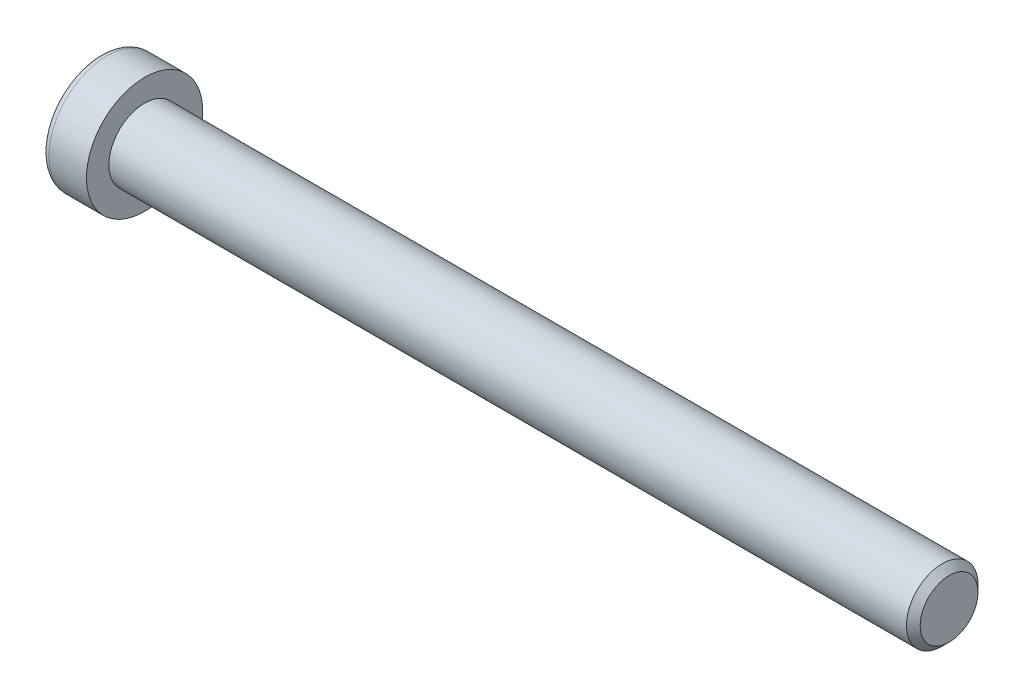
ISO-10303-21;
HEADER;
FILE_DESCRIPTION(('STEP AP214'),'2;1');
FILE_NAME('part.step','',(''),(''),'','','');
FILE_SCHEMA(('AUTOMOTIVE_DESIGN { 1 0 10303 214 1 1 1 1 }'));
ENDSEC;
DATA;
#1=APPLICATION_CONTEXT('core data for automotive mechanical design processes');
#2=APPLICATION_PROTOCOL_DEFINITION('international standard','automotive_design',2000,#1);
#3=PRODUCT_CONTEXT('',#1,'mechanical');
#4=PRODUCT('Part','Part','',(#3));
#5=PRODUCT_RELATED_PRODUCT_CATEGORY('part','',(#4));
#6=PRODUCT_DEFINITION_FORMATION('','',#4);
#7=PRODUCT_DEFINITION_CONTEXT('part definition',#1,'design');
#8=PRODUCT_DEFINITION('design','',#6,#7);
#9=PRODUCT_DEFINITION_SHAPE('','',#8);
#10=(LENGTH_UNIT() NAMED_UNIT(*) SI_UNIT(.MILLI.,.METRE.));
#11=(NAMED_UNIT(*) PLANE_ANGLE_UNIT() SI_UNIT($,.RADIAN.));
#12=(NAMED_UNIT(*) SI_UNIT($,.STERADIAN.) SOLID_ANGLE_UNIT());
#13=UNCERTAINTY_MEASURE_WITH_UNIT(LENGTH_MEASURE(1.E-05),#10,'distance_accuracy_value','');
#14=(GEOMETRIC_REPRESENTATION_CONTEXT(3) GLOBAL_UNCERTAINTY_ASSIGNED_CONTEXT((#13)) GLOBAL_UNIT_ASSIGNED_CONTEXT((#10,
#11,#12)) REPRESENTATION_CONTEXT('',''));
#15=CARTESIAN_POINT('',(0.,0.,0.));
#16=DIRECTION('',(0.,0.,1.));
#17=DIRECTION('',(1.,0.,0.));
#18=AXIS2_PLACEMENT_3D('',#15,#16,#17);
#19=CARTESIAN_POINT('',(-1.21000000177673,0.,0.));
#20=DIRECTION('',(-1.,0.,0.));
#21=DIRECTION('',(0.,0.,1.));
#22=AXIS2_PLACEMENT_3D('',#19,#20,#21);
#23=CONICAL_SURFACE('',#22,2.90407185309505,1.04719754999957);
#24=CARTESIAN_POINT('',(0.466666668955895,5.6843418860808E-11,0.));
#25=VERTEX_POINT('',#24);
#26=VERTEX_LOOP('',#25);
#27=FACE_BOUND('',#26,.T.);
#28=CARTESIAN_POINT('',(-1.20000000185429,2.50000000042234,1.44337567243878));
#29=CARTESIAN_POINT('',(-1.16336943333853,2.50000000015169,1.31652043354164));
#30=CARTESIAN_POINT('',(-1.13005584829276,2.50000000004066,1.18857018204665));
#31=CARTESIAN_POINT('',(-1.07190798608053,2.49999999995925,0.93045430604843));
#32=CARTESIAN_POINT('',(-1.0470942771784,2.49999999998921,0.800284096818482));
#33=CARTESIAN_POINT('',(-1.00846995034978,2.50000000001052,0.541556812507297));
#34=CARTESIAN_POINT('',(-0.994402236146722,2.50000000000281,0.413039534784192));
#35=CARTESIAN_POINT('',(-0.977611461809563,2.4999999999972,0.155400578578008));
#36=CARTESIAN_POINT('',(-0.97487449412654,2.4999999999993,0.026279835899947));
#37=CARTESIAN_POINT('',(-0.980582864405528,2.50000000000061,-0.214968419940874));
#38=CARTESIAN_POINT('',(-0.987626608260427,2.50000000000017,-0.327132134370465));
#39=CARTESIAN_POINT('',(-1.00994662769971,2.49999999999984,-0.550728853213828));
#40=CARTESIAN_POINT('',(-1.02523052029679,2.49999999999995,-0.662161084843472));
#41=CARTESIAN_POINT('',(-1.06343729358341,2.50000000000005,-0.886218434013149));
#42=CARTESIAN_POINT('',(-1.0865220547246,2.50000000000003,-0.998815208377068));
#43=CARTESIAN_POINT('',(-1.13891470308709,2.49999999999998,-1.22232986192457));
#44=CARTESIAN_POINT('',(-1.16821028802302,2.49999999999995,-1.33325060238035));
#45=CARTESIAN_POINT('',(-1.20000000212892,2.5,-1.44337567243228));
#46=B_SPLINE_CURVE_WITH_KNOTS('',3,(#28,#29,#30,#31,#32,#33,#34,#35,#36,#37,#38,#39,#40,#41,#42,
#43,#44,#45),.UNSPECIFIED.,.F.,.F.,(4,2,2,2,2,2,2,2,4),(0.,0.396270014512682,0.793492271431064,
1.18088450787844,1.56780111134321,1.90463472820817,2.2417802418617,2.586402027447,
2.93034746594209),.UNSPECIFIED.);
#47=CARTESIAN_POINT('',(-1.20000000210952,2.49999999973631,1.44337567282182));
#48=VERTEX_POINT('',#47);
#49=CARTESIAN_POINT('',(-1.20000000219742,2.5,-1.44337567266958));
#50=VERTEX_POINT('',#49);
#51=EDGE_CURVE('E19',#48,#50,#46,.T.);
#52=ORIENTED_EDGE('',*,*,#51,.T.);
#53=CARTESIAN_POINT('',(-1.20000000185429,2.4999999997476,-1.44337567360747));
#54=CARTESIAN_POINT('',(-1.16336943333853,2.3901401401242,-1.50680329282164));
#55=CARTESIAN_POINT('',(-1.13005584829276,2.27933197185342,-1.57077841847298));
#56=CARTESIAN_POINT('',(-1.07190798608053,2.05579706607819,-1.69983635640159));
#57=CARTESIAN_POINT('',(-1.0470942771784,1.9430663580841,-1.76492146104251));
#58=CARTESIAN_POINT('',(-1.00846995034978,1.71900195722911,-1.89428510321656));
#59=CARTESIAN_POINT('',(-0.994402236146722,1.60770272989182,-1.95854374207143));
#60=CARTESIAN_POINT('',(-0.977611461809562,1.38458084880996,-2.08736322016967));
#61=CARTESIAN_POINT('',(-0.974874494126539,1.27275900549629,-2.15192359151051));
#62=CARTESIAN_POINT('',(-0.980582864405527,1.06383188732011,-2.27254771943206));
#63=CARTESIAN_POINT('',(-0.987626608260426,0.966695261241037,-2.32862957664647));
#64=CARTESIAN_POINT('',(-1.00994662769971,0.773054822519673,-2.44042793606787));
#65=CARTESIAN_POINT('',(-1.02523052029679,0.676551679128068,-2.49614405188279));
#66=CARTESIAN_POINT('',(-1.06343729358341,0.482512322842576,-2.60817272646771));
#67=CARTESIAN_POINT('',(-1.0865220547246,0.385000655859225,-2.66447111364965));
#68=CARTESIAN_POINT('',(-1.13891470308709,0.191431287768985,-2.77622844042336));
#69=CARTESIAN_POINT('',(-1.16821028802302,0.0953711087276893,-2.83168881065123));
#70=CARTESIAN_POINT('',(-1.20000000212891,4.69203677421693E-10,-2.88675134567723));
#71=B_SPLINE_CURVE_WITH_KNOTS('',3,(#53,#54,#55,#56,#57,#58,#59,#60,#61,#62,#63,#64,#65,#66,#67,
#68,#69,#70),.UNSPECIFIED.,.F.,.F.,(4,2,2,2,2,2,2,2,4),(0.,0.396270014512682,0.793492271431064,
1.18088450787844,1.56780111134321,1.90463472820816,2.2417802418617,2.586402027447,
2.93034746594209),.UNSPECIFIED.);
#72=CARTESIAN_POINT('',(-1.20000000210952,0.,-2.88675134564365));
#73=VERTEX_POINT('',#72);
#74=EDGE_CURVE('E79',#50,#73,#71,.T.);
#75=ORIENTED_EDGE('',*,*,#74,.T.);
#76=CARTESIAN_POINT('',(-1.20000000185429,-6.74740305693329E-10,-2.88675134604625));
#77=CARTESIAN_POINT('',(-1.16336943333853,-0.109859860027481,-2.82332372636328));
#78=CARTESIAN_POINT('',(-1.13005584829276,-0.220668028187231,-2.75934860051963));
#79=CARTESIAN_POINT('',(-1.07190798608053,-0.44420293388106,-2.63029066245002));
#80=CARTESIAN_POINT('',(-1.0470942771784,-0.556933641905113,-2.565205557861));
#81=CARTESIAN_POINT('',(-1.00846995034978,-0.780998042781413,-2.43584191572386));
#82=CARTESIAN_POINT('',(-0.994402236146722,-0.892297270110983,-2.37158327685562));
#83=CARTESIAN_POINT('',(-0.977611461809562,-1.11541915118724,-2.24276379874768));
#84=CARTESIAN_POINT('',(-0.974874494126539,-1.22724099450301,-2.17820342741046));
#85=CARTESIAN_POINT('',(-0.980582864405527,-1.4361681126805,-2.05757929949119));
#86=CARTESIAN_POINT('',(-0.987626608260426,-1.53330473875913,-2.00149744227601));
#87=CARTESIAN_POINT('',(-1.00994662769971,-1.72694517748016,-1.88969908285404));
#88=CARTESIAN_POINT('',(-1.02523052029679,-1.82344832087188,-1.83398296703932));
#89=CARTESIAN_POINT('',(-1.06343729358341,-2.01748767715747,-1.72195429245457));
#90=CARTESIAN_POINT('',(-1.0865220547246,-2.1149993441408,-1.66565590527259));
#91=CARTESIAN_POINT('',(-1.13891470308709,-2.30856871223099,-1.55389857849879));
#92=CARTESIAN_POINT('',(-1.16821028802302,-2.40462889127226,-1.49843820827088));
#93=CARTESIAN_POINT('',(-1.20000000212892,-2.4999999995308,-1.44337567324496));
#94=B_SPLINE_CURVE_WITH_KNOTS('',3,(#76,#77,#78,#79,#80,#81,#82,#83,#84,#85,#86,#87,#88,#89,#90,
#91,#92,#93),.UNSPECIFIED.,.F.,.F.,(4,2,2,2,2,2,2,2,4),(0.,0.396270014512681,0.793492271431064,
1.18088450787844,1.56780111134321,1.90463472820817,2.2417802418617,2.58640202744701,
2.93034746594209),.UNSPECIFIED.);
#95=CARTESIAN_POINT('',(-1.20000000210952,-2.49999999973631,-1.44337567282182));
#96=VERTEX_POINT('',#95);
#97=EDGE_CURVE('E104',#73,#96,#94,.T.);
#98=ORIENTED_EDGE('',*,*,#97,.T.);
#99=CARTESIAN_POINT('',(-1.20000000185429,-2.50000000042234,-1.44337567243878));
#100=CARTESIAN_POINT('',(-1.16336943333853,-2.50000000015169,-1.31652043354164));
#101=CARTESIAN_POINT('',(-1.13005584829276,-2.50000000004065,-1.18857018204665));
#102=CARTESIAN_POINT('',(-1.07190798608053,-2.49999999995925,-0.930454306048433));
#103=CARTESIAN_POINT('',(-1.0470942771784,-2.49999999998921,-0.800284096818485));
#104=CARTESIAN_POINT('',(-1.00846995034978,-2.50000000001052,-0.5415568125073));
#105=CARTESIAN_POINT('',(-0.994402236146721,-2.5000000000028,-0.413039534784196));
#106=CARTESIAN_POINT('',(-0.977611461809562,-2.4999999999972,-0.155400578578012));
#107=CARTESIAN_POINT('',(-0.974874494126539,-2.4999999999993,-0.0262798358999509));
#108=CARTESIAN_POINT('',(-0.980582864405527,-2.50000000000061,0.214968419940871));
#109=CARTESIAN_POINT('',(-0.987626608260426,-2.50000000000016,0.327132134370461));
#110=CARTESIAN_POINT('',(-1.00994662769971,-2.49999999999984,0.550728853213825));
#111=CARTESIAN_POINT('',(-1.02523052029678,-2.49999999999995,0.662161084843469));
#112=CARTESIAN_POINT('',(-1.06343729358341,-2.50000000000005,0.886218434013146));
#113=CARTESIAN_POINT('',(-1.0865220547246,-2.50000000000002,0.998815208377065));
#114=CARTESIAN_POINT('',(-1.13891470308709,-2.49999999999998,1.22232986192457));
#115=CARTESIAN_POINT('',(-1.16821028802301,-2.49999999999995,1.33325060238035));
#116=CARTESIAN_POINT('',(-1.20000000212891,-2.5,1.44337567243227));
#117=B_SPLINE_CURVE_WITH_KNOTS('',3,(#99,#100,#101,#102,#103,#104,#105,#106,#107,#108,#109,#110,
#111,#112,#113,#114,#115,#116),.UNSPECIFIED.,.F.,.F.,(4,2,2,2,2,2,2,2,4),(0.,0.396270014512682,
0.793492271431064,1.18088450787844,1.56780111134321,1.90463472820816,2.2417802418617,
2.586402027447,2.93034746594209),.UNSPECIFIED.);
#118=CARTESIAN_POINT('',(-1.20000000210952,-2.49999999973631,1.44337567282182));
#119=VERTEX_POINT('',#118);
#120=EDGE_CURVE('E128',#96,#119,#117,.T.);
#121=ORIENTED_EDGE('',*,*,#120,.T.);
#122=CARTESIAN_POINT('',(-1.20000000185429,-2.4999999997476,1.44337567360746));
#123=CARTESIAN_POINT('',(-1.16336943333853,-2.39014014012421,1.50680329282164));
#124=CARTESIAN_POINT('',(-1.13005584829276,-2.27933197185342,1.57077841847298));
#125=CARTESIAN_POINT('',(-1.07190798608053,-2.05579706607819,1.69983635640159));
#126=CARTESIAN_POINT('',(-1.0470942771784,-1.9430663580841,1.76492146104251));
#127=CARTESIAN_POINT('',(-1.00846995034978,-1.71900195722911,1.89428510321656));
#128=CARTESIAN_POINT('',(-0.994402236146722,-1.60770272989182,1.95854374207143));
#129=CARTESIAN_POINT('',(-0.977611461809562,-1.38458084880996,2.08736322016966));
#130=CARTESIAN_POINT('',(-0.974874494126539,-1.27275900549629,2.15192359151051));
#131=CARTESIAN_POINT('',(-0.980582864405527,-1.06383188732011,2.27254771943206));
#132=CARTESIAN_POINT('',(-0.987626608260426,-0.966695261241039,2.32862957664647));
#133=CARTESIAN_POINT('',(-1.00994662769971,-0.773054822519674,2.44042793606787));
#134=CARTESIAN_POINT('',(-1.02523052029678,-0.676551679128069,2.49614405188279));
#135=CARTESIAN_POINT('',(-1.06343729358341,-0.482512322842577,2.60817272646771));
#136=CARTESIAN_POINT('',(-1.0865220547246,-0.385000655859226,2.66447111364965));
#137=CARTESIAN_POINT('',(-1.13891470308709,-0.191431287768986,2.77622844042336));
#138=CARTESIAN_POINT('',(-1.16821028802302,-0.0953711087276898,2.83168881065123));
#139=CARTESIAN_POINT('',(-1.20000000212891,-4.69203937650446E-10,2.88675134567723));
#140=B_SPLINE_CURVE_WITH_KNOTS('',3,(#122,#123,#124,#125,#126,#127,#128,#129,#130,#131,#132,
#133,#134,#135,#136,#137,#138,#139),.UNSPECIFIED.,.F.,.F.,(4,2,2,2,2,2,2,2,4),(0.,
0.396270014512682,0.793492271431064,1.18088450787844,1.56780111134321,1.90463472820817,
2.2417802418617,2.58640202744701,2.93034746594209),.UNSPECIFIED.);
#141=CARTESIAN_POINT('',(-1.20000000210952,0.,2.88675134564365));
#142=VERTEX_POINT('',#141);
#143=EDGE_CURVE('E136',#119,#142,#140,.T.);
#144=ORIENTED_EDGE('',*,*,#143,.T.);
#145=CARTESIAN_POINT('',(-1.20000000185429,6.74739340867099E-10,2.88675134604625));
#146=CARTESIAN_POINT('',(-1.16336943333853,0.10985986002748,2.82332372636328));
#147=CARTESIAN_POINT('',(-1.13005584829276,0.22066802818723,2.75934860051963));
#148=CARTESIAN_POINT('',(-1.07190798608053,0.444202933881059,2.63029066245002));
#149=CARTESIAN_POINT('',(-1.0470942771784,0.556933641905111,2.565205557861));
#150=CARTESIAN_POINT('',(-1.00846995034978,0.780998042781411,2.43584191572386));
#151=CARTESIAN_POINT('',(-0.994402236146721,0.892297270110982,2.37158327685562));
#152=CARTESIAN_POINT('',(-0.977611461809561,1.11541915118724,2.24276379874768));
#153=CARTESIAN_POINT('',(-0.974874494126538,1.227240994503,2.17820342741046));
#154=CARTESIAN_POINT('',(-0.980582864405526,1.4361681126805,2.05757929949119));
#155=CARTESIAN_POINT('',(-0.987626608260425,1.53330473875913,2.00149744227601));
#156=CARTESIAN_POINT('',(-1.00994662769971,1.72694517748016,1.88969908285404));
#157=CARTESIAN_POINT('',(-1.02523052029678,1.82344832087188,1.83398296703932));
#158=CARTESIAN_POINT('',(-1.06343729358341,2.01748767715747,1.72195429245456));
#159=CARTESIAN_POINT('',(-1.0865220547246,2.1149993441408,1.66565590527258));
#160=CARTESIAN_POINT('',(-1.13891470308709,2.30856871223099,1.55389857849879));
#161=CARTESIAN_POINT('',(-1.16821028802301,2.40462889127226,1.49843820827088));
#162=CARTESIAN_POINT('',(-1.20000000212891,2.4999999995308,1.44337567324495));
#163=B_SPLINE_CURVE_WITH_KNOTS('',3,(#145,#146,#147,#148,#149,#150,#151,#152,#153,#154,#155,
#156,#157,#158,#159,#160,#161,#162),.UNSPECIFIED.,.F.,.F.,(4,2,2,2,2,2,2,2,4),(0.,
0.396270014512682,0.793492271431064,1.18088450787844,1.56780111134321,1.90463472820817,
2.2417802418617,2.58640202744701,2.93034746594209),.UNSPECIFIED.);
#164=EDGE_CURVE('E81',#142,#48,#163,.T.);
#165=ORIENTED_EDGE('',*,*,#164,.T.);
#166=EDGE_LOOP('',(#52,#75,#98,#121,#144,#165));
#167=FACE_BOUND('',#166,.T.);
#168=ADVANCED_FACE('F15',(#27,#167),#23,.F.);
#169=CARTESIAN_POINT('',(-5.,2.5,1.44337567297406));
#170=DIRECTION('',(0.,1.,0.));
#171=DIRECTION('',(0.,0.,1.));
#172=AXIS2_PLACEMENT_3D('',#169,#170,#171);
#173=PLANE('',#172);
#174=DIRECTION('',(1.,0.,0.));
#175=VECTOR('',#174,1.);
#176=CARTESIAN_POINT('',(-5.,2.5,1.44337567297406));
#177=LINE('',#176,#175);
#178=CARTESIAN_POINT('',(-5.,2.5,1.44337567297406));
#179=VERTEX_POINT('',#178);
#180=EDGE_CURVE('E83',#48,#179,#177,.F.);
#181=ORIENTED_EDGE('',*,*,#180,.T.);
#182=DIRECTION('',(0.,0.,1.));
#183=VECTOR('',#182,1.);
#184=CARTESIAN_POINT('',(-5.,2.5,0.));
#185=LINE('',#184,#183);
#186=CARTESIAN_POINT('',(-5.,2.5,-1.44337567297407));
#187=VERTEX_POINT('',#186);
#188=EDGE_CURVE('E88',#187,#179,#185,.T.);
#189=ORIENTED_EDGE('',*,*,#188,.F.);
#190=DIRECTION('',(1.,0.,0.));
#191=VECTOR('',#190,1.);
#192=CARTESIAN_POINT('',(-5.,2.5,-1.44337567297407));
#193=LINE('',#192,#191);
#194=EDGE_CURVE('E86',#187,#50,#193,.T.);
#195=ORIENTED_EDGE('',*,*,#194,.T.);
#196=ORIENTED_EDGE('',*,*,#51,.F.);
#197=EDGE_LOOP('',(#181,#189,#195,#196));
#198=FACE_BOUND('',#197,.T.);
#199=ADVANCED_FACE('F75',(#198),#173,.F.);
#200=CARTESIAN_POINT('',(-5.,0.,2.88675134594813));
#201=DIRECTION('',(0.,0.500000000000001,0.866025403784438));
#202=DIRECTION('',(0.,-0.866025403784438,0.500000000000001));
#203=AXIS2_PLACEMENT_3D('',#200,#201,#202);
#204=PLANE('',#203);
#205=DIRECTION('',(1.,0.,0.));
#206=VECTOR('',#205,1.);
#207=CARTESIAN_POINT('',(-5.,0.,2.88675134594813));
#208=LINE('',#207,#206);
#209=CARTESIAN_POINT('',(-5.,0.,2.88675134594813));
#210=VERTEX_POINT('',#209);
#211=EDGE_CURVE('E140',#142,#210,#208,.F.);
#212=ORIENTED_EDGE('',*,*,#211,.T.);
#213=DIRECTION('',(0.,-0.866025403784438,0.500000000000001));
#214=VECTOR('',#213,1.);
#215=CARTESIAN_POINT('',(-5.,2.5,1.44337567297406));
#216=LINE('',#215,#214);
#217=EDGE_CURVE('E94',#179,#210,#216,.T.);
#218=ORIENTED_EDGE('',*,*,#217,.F.);
#219=ORIENTED_EDGE('',*,*,#180,.F.);
#220=ORIENTED_EDGE('',*,*,#164,.F.);
#221=EDGE_LOOP('',(#212,#218,#219,#220));
#222=FACE_BOUND('',#221,.T.);
#223=ADVANCED_FACE('F144',(#222),#204,.F.);
#224=CARTESIAN_POINT('',(-5.,-2.5,1.44337567297406));
#225=DIRECTION('',(0.,-0.5,0.866025403784439));
#226=DIRECTION('',(0.,-0.866025403784439,-0.5));
#227=AXIS2_PLACEMENT_3D('',#224,#225,#226);
#228=PLANE('',#227);
#229=DIRECTION('',(1.,0.,0.));
#230=VECTOR('',#229,1.);
#231=CARTESIAN_POINT('',(-5.,-2.5,1.44337567297406));
#232=LINE('',#231,#230);
#233=CARTESIAN_POINT('',(-5.,-2.5,1.44337567297406));
#234=VERTEX_POINT('',#233);
#235=EDGE_CURVE('E135',#119,#234,#232,.F.);
#236=ORIENTED_EDGE('',*,*,#235,.T.);
#237=DIRECTION('',(0.,-0.866025403784439,-0.5));
#238=VECTOR('',#237,1.);
#239=CARTESIAN_POINT('',(-5.,0.,2.88675134594813));
#240=LINE('',#239,#238);
#241=EDGE_CURVE('E223',#210,#234,#240,.T.);
#242=ORIENTED_EDGE('',*,*,#241,.F.);
#243=ORIENTED_EDGE('',*,*,#211,.F.);
#244=ORIENTED_EDGE('',*,*,#143,.F.);
#245=EDGE_LOOP('',(#236,#242,#243,#244));
#246=FACE_BOUND('',#245,.T.);
#247=ADVANCED_FACE('F124',(#246),#228,.F.);
#248=CARTESIAN_POINT('',(-5.,-2.5,-1.44337567297406));
#249=DIRECTION('',(0.,-1.,0.));
#250=DIRECTION('',(0.,0.,-1.));
#251=AXIS2_PLACEMENT_3D('',#248,#249,#250);
#252=PLANE('',#251);
#253=DIRECTION('',(1.,0.,0.));
#254=VECTOR('',#253,1.);
#255=CARTESIAN_POINT('',(-5.,-2.5,-1.44337567297406));
#256=LINE('',#255,#254);
#257=CARTESIAN_POINT('',(-5.,-2.5,-1.44337567297406));
#258=VERTEX_POINT('',#257);
#259=EDGE_CURVE('E134',#96,#258,#256,.F.);
#260=ORIENTED_EDGE('',*,*,#259,.T.);
#261=DIRECTION('',(0.,0.,1.));
#262=VECTOR('',#261,1.);
#263=CARTESIAN_POINT('',(-5.,-2.5,0.));
#264=LINE('',#263,#262);
#265=EDGE_CURVE('E220',#234,#258,#264,.F.);
#266=ORIENTED_EDGE('',*,*,#265,.F.);
#267=ORIENTED_EDGE('',*,*,#235,.F.);
#268=ORIENTED_EDGE('',*,*,#120,.F.);
#269=EDGE_LOOP('',(#260,#266,#267,#268));
#270=FACE_BOUND('',#269,.T.);
#271=ADVANCED_FACE('F120',(#270),#252,.F.);
#272=CARTESIAN_POINT('',(-5.,0.,-2.88675134594813));
#273=DIRECTION('',(0.,-0.5,-0.866025403784439));
#274=DIRECTION('',(0.,0.866025403784439,-0.5));
#275=AXIS2_PLACEMENT_3D('',#272,#273,#274);
#276=PLANE('',#275);
#277=DIRECTION('',(1.,0.,0.));
#278=VECTOR('',#277,1.);
#279=CARTESIAN_POINT('',(-5.,0.,-2.88675134594813));
#280=LINE('',#279,#278);
#281=CARTESIAN_POINT('',(-5.,0.,-2.88675134594813));
#282=VERTEX_POINT('',#281);
#283=EDGE_CURVE('E37',#73,#282,#280,.F.);
#284=ORIENTED_EDGE('',*,*,#283,.T.);
#285=DIRECTION('',(0.,0.866025403784438,-0.500000000000001));
#286=VECTOR('',#285,1.);
#287=CARTESIAN_POINT('',(-5.,-2.5,-1.44337567297406));
#288=LINE('',#287,#286);
#289=EDGE_CURVE('E217',#258,#282,#288,.T.);
#290=ORIENTED_EDGE('',*,*,#289,.F.);
#291=ORIENTED_EDGE('',*,*,#259,.F.);
#292=ORIENTED_EDGE('',*,*,#97,.F.);
#293=EDGE_LOOP('',(#284,#290,#291,#292));
#294=FACE_BOUND('',#293,.T.);
#295=ADVANCED_FACE('F114',(#294),#276,.F.);
#296=CARTESIAN_POINT('',(-5.,2.5,-1.44337567297407));
#297=DIRECTION('',(0.,0.5,-0.866025403784439));
#298=DIRECTION('',(0.,0.866025403784439,0.5));
#299=AXIS2_PLACEMENT_3D('',#296,#297,#298);
#300=PLANE('',#299);
#301=ORIENTED_EDGE('',*,*,#194,.F.);
#302=DIRECTION('',(0.,0.866025403784439,0.5));
#303=VECTOR('',#302,1.);
#304=CARTESIAN_POINT('',(-5.,0.,-2.88675134594813));
#305=LINE('',#304,#303);
#306=EDGE_CURVE('E215',#282,#187,#305,.T.);
#307=ORIENTED_EDGE('',*,*,#306,.F.);
#308=ORIENTED_EDGE('',*,*,#283,.F.);
#309=ORIENTED_EDGE('',*,*,#74,.F.);
#310=EDGE_LOOP('',(#301,#307,#308,#309));
#311=FACE_BOUND('',#310,.T.);
#312=ADVANCED_FACE('F92',(#311),#300,.F.);
#313=CARTESIAN_POINT('',(-5.,4.69337567297407,0.));
#314=DIRECTION('',(-1.,0.,0.));
#315=DIRECTION('',(0.,0.,1.));
#316=AXIS2_PLACEMENT_3D('',#313,#314,#315);
#317=PLANE('',#316);
#318=ORIENTED_EDGE('',*,*,#289,.T.);
#319=ORIENTED_EDGE('',*,*,#306,.T.);
#320=ORIENTED_EDGE('',*,*,#188,.T.);
#321=ORIENTED_EDGE('',*,*,#217,.T.);
#322=ORIENTED_EDGE('',*,*,#241,.T.);
#323=ORIENTED_EDGE('',*,*,#265,.T.);
#324=EDGE_LOOP('',(#318,#319,#320,#321,#322,#323));
#325=FACE_BOUND('',#324,.T.);
#326=CARTESIAN_POINT('',(-5.,0.,0.));
#327=DIRECTION('',(1.,0.,0.));
#328=DIRECTION('',(0.,1.,0.));
#329=AXIS2_PLACEMENT_3D('',#326,#327,#328);
#330=CIRCLE('',#329,5.7);
#331=CARTESIAN_POINT('',(-5.,5.7,0.));
#332=VERTEX_POINT('',#331);
#333=EDGE_CURVE('E192',#332,#332,#330,.T.);
#334=ORIENTED_EDGE('',*,*,#333,.F.);
#335=EDGE_LOOP('',(#334));
#336=FACE_BOUND('',#335,.T.);
#337=ADVANCED_FACE('F113',(#325,#336),#317,.T.);
#338=CARTESIAN_POINT('',(-4.2,0.,0.));
#339=DIRECTION('',(1.,0.,0.));
#340=DIRECTION('',(0.,0.,-1.));
#341=AXIS2_PLACEMENT_3D('',#338,#339,#340);
#342=TOROIDAL_SURFACE('',#341,5.7,0.8);
#343=CARTESIAN_POINT('',(-4.2,0.,0.));
#344=DIRECTION('',(1.,0.,0.));
#345=DIRECTION('',(0.,1.,0.));
#346=AXIS2_PLACEMENT_3D('',#343,#344,#345);
#347=CIRCLE('',#346,6.5);
#348=CARTESIAN_POINT('',(-4.2,6.5,0.));
#349=VERTEX_POINT('',#348);
#350=EDGE_CURVE('E233',#349,#349,#347,.T.);
#351=ORIENTED_EDGE('',*,*,#350,.F.);
#352=EDGE_LOOP('',(#351));
#353=FACE_BOUND('',#352,.T.);
#354=ORIENTED_EDGE('',*,*,#333,.T.);
#355=EDGE_LOOP('',(#354));
#356=FACE_BOUND('',#355,.T.);
#357=ADVANCED_FACE('F176',(#353,#356),#342,.T.);
#358=CARTESIAN_POINT('',(-2.5,0.,0.));
#359=DIRECTION('',(1.,0.,0.));
#360=DIRECTION('',(0.,1.,0.));
#361=AXIS2_PLACEMENT_3D('',#358,#359,#360);
#362=CYLINDRICAL_SURFACE('',#361,6.5);
#363=ORIENTED_EDGE('',*,*,#350,.T.);
#364=EDGE_LOOP('',(#363));
#365=FACE_BOUND('',#364,.T.);
#366=CARTESIAN_POINT('',(0.,0.,0.));
#367=DIRECTION('',(1.,0.,0.));
#368=DIRECTION('',(0.,1.,0.));
#369=AXIS2_PLACEMENT_3D('',#366,#367,#368);
#370=CIRCLE('',#369,6.5);
#371=CARTESIAN_POINT('',(0.,6.5,0.));
#372=VERTEX_POINT('',#371);
#373=EDGE_CURVE('E102',#372,#372,#370,.T.);
#374=ORIENTED_EDGE('',*,*,#373,.F.);
#375=EDGE_LOOP('',(#374));
#376=FACE_BOUND('',#375,.T.);
#377=ADVANCED_FACE('F173',(#365,#376),#362,.T.);
#378=CARTESIAN_POINT('',(90.,2.,0.));
#379=DIRECTION('',(1.,0.,0.));
#380=DIRECTION('',(0.,0.,-1.));
#381=AXIS2_PLACEMENT_3D('',#378,#379,#380);
#382=PLANE('',#381);
#383=CARTESIAN_POINT('',(90.000000000316,0.,0.));
#384=DIRECTION('',(-1.,0.,0.));
#385=DIRECTION('',(0.,0.,1.));
#386=AXIS2_PLACEMENT_3D('',#383,#384,#385);
#387=CIRCLE('',#386,3.2331875003706);
#388=CARTESIAN_POINT('',(90.000000000316,0.,3.2331875003706));
#389=VERTEX_POINT('',#388);
#390=EDGE_CURVE('E229',#389,#389,#387,.T.);
#391=ORIENTED_EDGE('',*,*,#390,.F.);
#392=EDGE_LOOP('',(#391));
#393=FACE_BOUND('',#392,.T.);
#394=ADVANCED_FACE('F169',(#393),#382,.T.);
#395=CARTESIAN_POINT('',(0.,5.25,0.));
#396=DIRECTION('',(1.,0.,0.));
#397=DIRECTION('',(0.,0.,-1.));
#398=AXIS2_PLACEMENT_3D('',#395,#396,#397);
#399=PLANE('',#398);
#400=CARTESIAN_POINT('',(0.,0.,0.));
#401=DIRECTION('',(1.,0.,0.));
#402=DIRECTION('',(0.,1.,0.));
#403=AXIS2_PLACEMENT_3D('',#400,#401,#402);
#404=CIRCLE('',#403,4.00000000000001);
#405=CARTESIAN_POINT('',(0.,4.00000000000001,0.));
#406=VERTEX_POINT('',#405);
#407=EDGE_CURVE('E28',#406,#406,#404,.T.);
#408=ORIENTED_EDGE('',*,*,#407,.F.);
#409=EDGE_LOOP('',(#408));
#410=FACE_BOUND('',#409,.T.);
#411=ORIENTED_EDGE('',*,*,#373,.T.);
#412=EDGE_LOOP('',(#411));
#413=FACE_BOUND('',#412,.T.);
#414=ADVANCED_FACE('F162',(#410,#413),#399,.T.);
#415=CARTESIAN_POINT('',(89.2331874997012,0.,0.));
#416=DIRECTION('',(-1.,0.,0.));
#417=DIRECTION('',(0.,0.,1.));
#418=AXIS2_PLACEMENT_3D('',#415,#416,#417);
#419=CONICAL_SURFACE('',#418,3.9999999996212,0.785398162507894);
#420=ORIENTED_EDGE('',*,*,#390,.T.);
#421=EDGE_LOOP('',(#420));
#422=FACE_BOUND('',#421,.T.);
#423=CARTESIAN_POINT('',(89.2331875,0.,0.));
#424=DIRECTION('',(1.,0.,0.));
#425=DIRECTION('',(0.,1.,0.));
#426=AXIS2_PLACEMENT_3D('',#423,#424,#425);
#427=CIRCLE('',#426,4.00000000000001);
#428=CARTESIAN_POINT('',(89.2331875,4.00000000000001,0.));
#429=VERTEX_POINT('',#428);
#430=EDGE_CURVE('E10',#429,#429,#427,.F.);
#431=ORIENTED_EDGE('',*,*,#430,.F.);
#432=EDGE_LOOP('',(#431));
#433=FACE_BOUND('',#432,.T.);
#434=ADVANCED_FACE('F155',(#422,#433),#419,.T.);
#435=CARTESIAN_POINT('',(79.,0.,0.));
#436=DIRECTION('',(1.,0.,0.));
#437=DIRECTION('',(0.,1.,0.));
#438=AXIS2_PLACEMENT_3D('',#435,#436,#437);
#439=CYLINDRICAL_SURFACE('',#438,4.00000000000001);
#440=ORIENTED_EDGE('',*,*,#430,.T.);
#441=EDGE_LOOP('',(#440));
#442=FACE_BOUND('',#441,.T.);
#443=ORIENTED_EDGE('',*,*,#407,.T.);
#444=EDGE_LOOP('',(#443));
#445=FACE_BOUND('',#444,.T.);
#446=ADVANCED_FACE('F153',(#442,#445),#439,.T.);
#447=CLOSED_SHELL('',(#168,#199,#223,#247,#271,#295,#312,#337,#357,#377,#394,#414,#434,#446));
#448=MANIFOLD_SOLID_BREP('B1',#447);
#449=ADVANCED_BREP_SHAPE_REPRESENTATION('',(#18,#448),#14);
#450=SHAPE_DEFINITION_REPRESENTATION(#9,#449);
ENDSEC;
END-ISO-10303-21;
